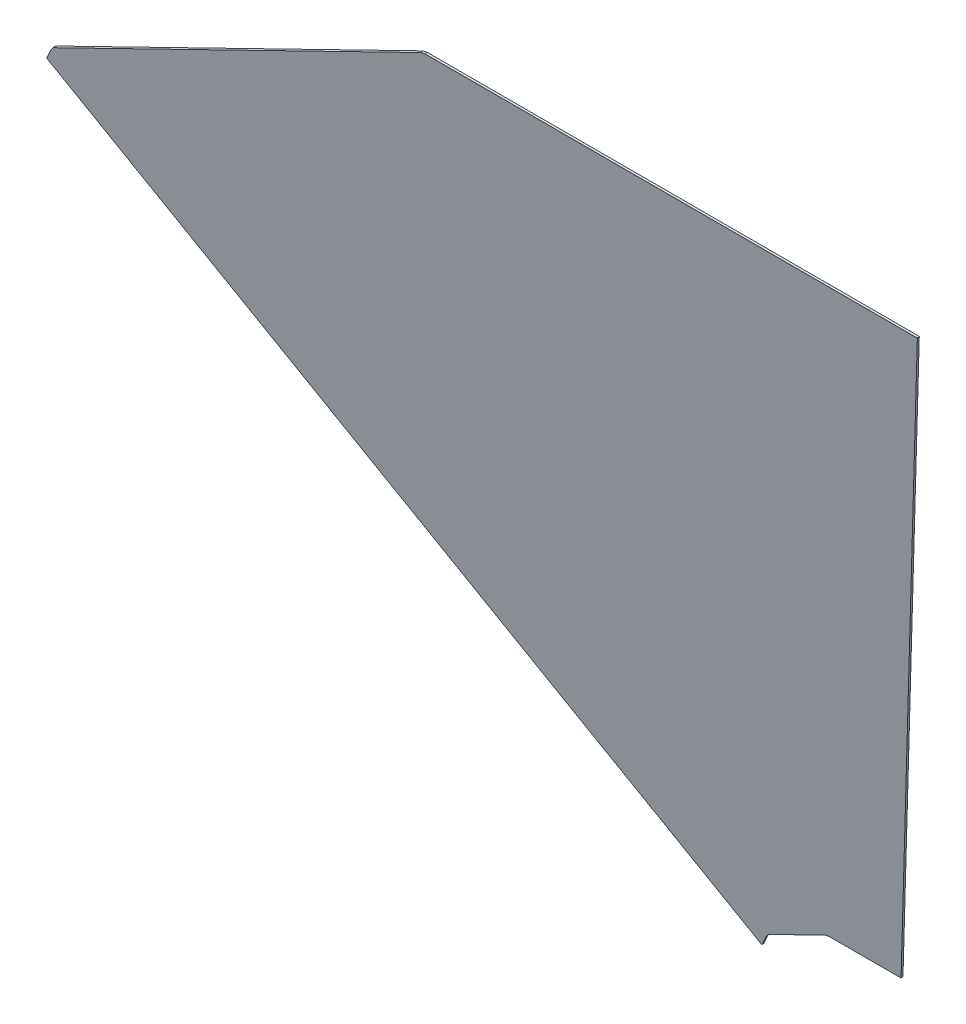
ISO-10303-21;
HEADER;
FILE_DESCRIPTION(('STEP AP214'),'2;1');
FILE_NAME('part.step','',(''),(''),'','','');
FILE_SCHEMA(('AUTOMOTIVE_DESIGN { 1 0 10303 214 1 1 1 1 }'));
ENDSEC;
DATA;
#1=APPLICATION_CONTEXT('core data for automotive mechanical design processes');
#2=APPLICATION_PROTOCOL_DEFINITION('international standard','automotive_design',2000,#1);
#3=PRODUCT_CONTEXT('',#1,'mechanical');
#4=PRODUCT('Part','Part','',(#3));
#5=PRODUCT_RELATED_PRODUCT_CATEGORY('part','',(#4));
#6=PRODUCT_DEFINITION_FORMATION('','',#4);
#7=PRODUCT_DEFINITION_CONTEXT('part definition',#1,'design');
#8=PRODUCT_DEFINITION('design','',#6,#7);
#9=PRODUCT_DEFINITION_SHAPE('','',#8);
#10=(LENGTH_UNIT() NAMED_UNIT(*) SI_UNIT(.MILLI.,.METRE.));
#11=(NAMED_UNIT(*) PLANE_ANGLE_UNIT() SI_UNIT($,.RADIAN.));
#12=(NAMED_UNIT(*) SI_UNIT($,.STERADIAN.) SOLID_ANGLE_UNIT());
#13=UNCERTAINTY_MEASURE_WITH_UNIT(LENGTH_MEASURE(1.E-05),#10,'distance_accuracy_value','');
#14=(GEOMETRIC_REPRESENTATION_CONTEXT(3) GLOBAL_UNCERTAINTY_ASSIGNED_CONTEXT((#13)) GLOBAL_UNIT_ASSIGNED_CONTEXT((#10,
#11,#12)) REPRESENTATION_CONTEXT('',''));
#15=CARTESIAN_POINT('',(0.,0.,0.));
#16=DIRECTION('',(0.,0.,1.));
#17=DIRECTION('',(1.,0.,0.));
#18=AXIS2_PLACEMENT_3D('',#15,#16,#17);
#19=CARTESIAN_POINT('',(-81.4927327948293,86.5041594757914,22.2174112125698));
#20=DIRECTION('',(0.502072542876718,-0.837725314470318,-0.214800975754098));
#21=DIRECTION('',(-0.864825509388631,-0.486339584462123,-0.124702232922686));
#22=AXIS2_PLACEMENT_3D('',#19,#20,#21);
#23=PLANE('',#22);
#24=DIRECTION('',(0.,-0.24837493045961,0.96866397368705));
#25=VECTOR('',#24,1.);
#26=CARTESIAN_POINT('',(-121.351346909395,63.9404143048598,17.0512557926561));
#27=LINE('',#26,#25);
#28=CARTESIAN_POINT('',(-121.351346909395,64.0894392631352,16.4700574084437));
#29=VERTEX_POINT('',#28);
#30=CARTESIAN_POINT('',(-121.351346909395,63.791389346584,17.6324541768683));
#31=VERTEX_POINT('',#30);
#32=EDGE_CURVE('E237',#29,#31,#27,.T.);
#33=ORIENTED_EDGE('',*,*,#32,.F.);
#34=DIRECTION('',(-0.864825509388632,-0.486339584462123,-0.124702232922685));
#35=VECTOR('',#34,1.);
#36=CARTESIAN_POINT('',(-81.492657451231,86.504201845696,22.2174220766283));
#37=LINE('',#36,#35);
#38=CARTESIAN_POINT('',(-81.4927327948294,86.5041594757914,22.2174112125698));
#39=VERTEX_POINT('',#38);
#40=EDGE_CURVE('E70',#39,#29,#37,.T.);
#41=ORIENTED_EDGE('',*,*,#40,.F.);
#42=DIRECTION('',(0.,0.24837493045961,-0.968663973687049));
#43=VECTOR('',#42,1.);
#44=CARTESIAN_POINT('',(-81.4927327948294,86.5041594757914,22.2174112125698));
#45=LINE('',#44,#43);
#46=CARTESIAN_POINT('',(-81.4927327948294,86.2061095592399,23.3798079809943));
#47=VERTEX_POINT('',#46);
#48=EDGE_CURVE('E54',#39,#47,#45,.F.);
#49=ORIENTED_EDGE('',*,*,#48,.T.);
#50=DIRECTION('',(-0.864825509388631,-0.486339584462123,-0.124702232922686));
#51=VECTOR('',#50,1.);
#52=CARTESIAN_POINT('',(-81.4927327948293,86.2061095592399,23.3798079809943));
#53=LINE('',#52,#51);
#54=EDGE_CURVE('E204',#47,#31,#53,.T.);
#55=ORIENTED_EDGE('',*,*,#54,.T.);
#56=EDGE_LOOP('',(#33,#41,#49,#55));
#57=FACE_BOUND('',#56,.T.);
#58=ADVANCED_FACE('F45',(#57),#23,.T.);
#59=CARTESIAN_POINT('',(-464.741445071575,394.337831515463,101.148979809011));
#60=DIRECTION('',(-0.502072542876719,0.837725314470321,0.214800975754088));
#61=DIRECTION('',(0.864825509388631,0.486339584462123,0.124702232922686));
#62=AXIS2_PLACEMENT_3D('',#59,#60,#61);
#63=PLANE('',#62);
#64=DIRECTION('',(0.,-0.248374930459611,0.968663973687049));
#65=VECTOR('',#64,1.);
#66=CARTESIAN_POINT('',(-207.292732794829,538.966566220514,138.852613800697));
#67=LINE('',#66,#65);
#68=CARTESIAN_POINT('',(-207.29273279483,539.11559117879,138.271415416485));
#69=VERTEX_POINT('',#68);
#70=CARTESIAN_POINT('',(-207.292732794829,538.817541262239,139.433812184909));
#71=VERTEX_POINT('',#70);
#72=EDGE_CURVE('E12',#69,#71,#67,.T.);
#73=ORIENTED_EDGE('',*,*,#72,.F.);
#74=DIRECTION('',(0.864825509388631,0.486339584462123,0.124702232922686));
#75=VECTOR('',#74,1.);
#76=CARTESIAN_POINT('',(-464.741445071575,394.337831515463,101.148979809011));
#77=LINE('',#76,#75);
#78=CARTESIAN_POINT('',(-464.741445071575,394.337831515464,101.148979809011));
#79=VERTEX_POINT('',#78);
#80=EDGE_CURVE('E62',#69,#79,#77,.F.);
#81=ORIENTED_EDGE('',*,*,#80,.T.);
#82=DIRECTION('',(0.,0.248374930459602,-0.968663973687051));
#83=VECTOR('',#82,1.);
#84=CARTESIAN_POINT('',(-464.741445071576,394.337831515463,101.148979809011));
#85=LINE('',#84,#83);
#86=CARTESIAN_POINT('',(-464.741445071575,394.039781598912,102.311376577435));
#87=VERTEX_POINT('',#86);
#88=EDGE_CURVE('E207',#79,#87,#85,.F.);
#89=ORIENTED_EDGE('',*,*,#88,.T.);
#90=DIRECTION('',(0.864825509388631,0.486339584462123,0.124702232922685));
#91=VECTOR('',#90,1.);
#92=CARTESIAN_POINT('',(-464.741445071575,394.039781598912,102.311376577435));
#93=LINE('',#92,#91);
#94=EDGE_CURVE('E208',#71,#87,#93,.F.);
#95=ORIENTED_EDGE('',*,*,#94,.F.);
#96=EDGE_LOOP('',(#73,#81,#89,#95));
#97=FACE_BOUND('',#96,.T.);
#98=ADVANCED_FACE('F282',(#97),#63,.T.);
#99=CARTESIAN_POINT('',(-114.,-0.306927143542762,1.19701801605478));
#100=DIRECTION('',(0.,0.248374930459612,-0.968663973687049));
#101=DIRECTION('',(0.,-0.968663973687049,-0.248374930459612));
#102=AXIS2_PLACEMENT_3D('',#99,#100,#101);
#103=PLANE('',#102);
#104=ORIENTED_EDGE('',*,*,#94,.T.);
#105=DIRECTION('',(-0.621655947087628,-0.758745211645701,-0.194549703817057));
#106=VECTOR('',#105,1.);
#107=CARTESIAN_POINT('',(-464.741445071575,394.039781598912,102.311376577435));
#108=LINE('',#107,#106);
#109=CARTESIAN_POINT('',(-466.428325961063,391.980905135956,101.783460486611));
#110=VERTEX_POINT('',#109);
#111=EDGE_CURVE('E218',#87,#110,#108,.T.);
#112=ORIENTED_EDGE('',*,*,#111,.T.);
#113=DIRECTION('',(-0.495846323378611,-0.841197757736622,-0.215691344218522));
#114=VECTOR('',#113,1.);
#115=CARTESIAN_POINT('',(-465.855281279463,392.953069047468,102.032732835409));
#116=LINE('',#115,#114);
#117=CARTESIAN_POINT('',(-470.99031138963,384.241547733465,99.7990134452606));
#118=VERTEX_POINT('',#117);
#119=EDGE_CURVE('E192',#118,#110,#116,.F.);
#120=ORIENTED_EDGE('',*,*,#119,.F.);
#121=DIRECTION('',(0.709642308138353,-0.682483952190832,-0.174995569949796));
#122=VECTOR('',#121,1.);
#123=CARTESIAN_POINT('',(-470.99031138963,384.241547733465,99.7990134452606));
#124=LINE('',#123,#122);
#125=CARTESIAN_POINT('',(-127.60021322745,53.9931554811372,15.1200910446933));
#126=VERTEX_POINT('',#125);
#127=EDGE_CURVE('E197',#126,#118,#124,.F.);
#128=ORIENTED_EDGE('',*,*,#127,.F.);
#129=DIRECTION('',(0.49584632337861,0.841197757736623,0.215691344218523));
#130=VECTOR('',#129,1.);
#131=CARTESIAN_POINT('',(-127.60021322745,53.9931554811372,15.1200910446933));
#132=LINE('',#131,#130);
#133=CARTESIAN_POINT('',(-123.038227798884,61.7325128836271,17.1045380860408));
#134=VERTEX_POINT('',#133);
#135=EDGE_CURVE('E176',#134,#126,#132,.F.);
#136=ORIENTED_EDGE('',*,*,#135,.F.);
#137=DIRECTION('',(0.621655947087619,0.75874521164571,0.194549703817052));
#138=VECTOR('',#137,1.);
#139=CARTESIAN_POINT('',(-123.038227798882,61.732512883628,17.1045380860436));
#140=LINE('',#139,#138);
#141=EDGE_CURVE('E213',#134,#31,#140,.T.);
#142=ORIENTED_EDGE('',*,*,#141,.T.);
#143=ORIENTED_EDGE('',*,*,#54,.F.);
#144=DIRECTION('',(0.965615220827785,0.251828872397682,0.0645713894276671));
#145=VECTOR('',#144,1.);
#146=CARTESIAN_POINT('',(-81.4927327948293,86.2061095592397,23.3798079809942));
#147=LINE('',#146,#145);
#148=CARTESIAN_POINT('',(-78.8886198219834,86.8852525754255,23.5539469022295));
#149=VERTEX_POINT('',#148);
#150=EDGE_CURVE('E229',#47,#149,#147,.T.);
#151=ORIENTED_EDGE('',*,*,#150,.T.);
#152=DIRECTION('',(-1.,0.,0.));
#153=VECTOR('',#152,1.);
#154=CARTESIAN_POINT('',(-35.906827580274,86.8852525754256,23.5539469022295));
#155=LINE('',#154,#153);
#156=CARTESIAN_POINT('',(-35.906827580274,86.8852525754255,23.5539469022296));
#157=VERTEX_POINT('',#156);
#158=EDGE_CURVE('E169',#157,#149,#155,.T.);
#159=ORIENTED_EDGE('',*,*,#158,.F.);
#160=DIRECTION('',(0.2599754705846,0.935356676859751,0.239834613323847));
#161=VECTOR('',#160,1.);
#162=CARTESIAN_POINT('',(-63.7814136844399,-13.4037484161088,-2.16113523541164));
#163=LINE('',#162,#161);
#164=CARTESIAN_POINT('',(89.8931724197261,539.496684278424,139.607951106145));
#165=VERTEX_POINT('',#164);
#166=EDGE_CURVE('E148',#157,#165,#163,.T.);
#167=ORIENTED_EDGE('',*,*,#166,.T.);
#168=DIRECTION('',(-1.,0.,0.));
#169=VECTOR('',#168,1.);
#170=CARTESIAN_POINT('',(-114.,539.496684278424,139.607951106144));
#171=LINE('',#170,#169);
#172=CARTESIAN_POINT('',(-204.688619821983,539.496684278424,139.607951106144));
#173=VERTEX_POINT('',#172);
#174=EDGE_CURVE('E143',#165,#173,#171,.T.);
#175=ORIENTED_EDGE('',*,*,#174,.T.);
#176=DIRECTION('',(-0.965615220827772,-0.251828872397731,-0.0645713894276717));
#177=VECTOR('',#176,1.);
#178=CARTESIAN_POINT('',(-204.688619821984,539.496684278424,139.607951106145));
#179=LINE('',#178,#177);
#180=EDGE_CURVE('E226',#173,#71,#179,.T.);
#181=ORIENTED_EDGE('',*,*,#180,.T.);
#182=EDGE_LOOP('',(#104,#112,#120,#128,#136,#142,#143,#151,#159,#167,#175,#181));
#183=FACE_BOUND('',#182,.T.);
#184=ADVANCED_FACE('F47',(#183),#103,.F.);
#185=CARTESIAN_POINT('',(-62.9345481407688,13.3088034420871,3.44940501157601));
#186=DIRECTION('',(0.,0.248374930459612,-0.968663973687049));
#187=DIRECTION('',(-0.859072998579085,0.495813645614607,0.127131474996138));
#188=AXIS2_PLACEMENT_3D('',#185,#186,#187);
#189=PLANE('',#188);
#190=ORIENTED_EDGE('',*,*,#80,.F.);
#191=DIRECTION('',(-0.965615220827772,-0.251828872397731,-0.0645713894276717));
#192=VECTOR('',#191,1.);
#193=CARTESIAN_POINT('',(-204.688619821984,539.794734194976,138.44555433772));
#194=LINE('',#193,#192);
#195=CARTESIAN_POINT('',(-204.688619821983,539.794734194976,138.44555433772));
#196=VERTEX_POINT('',#195);
#197=EDGE_CURVE('E154',#196,#69,#194,.T.);
#198=ORIENTED_EDGE('',*,*,#197,.F.);
#199=DIRECTION('',(1.,0.,0.));
#200=VECTOR('',#199,1.);
#201=CARTESIAN_POINT('',(-204.688619821983,539.794734194976,138.44555433772));
#202=LINE('',#201,#200);
#203=CARTESIAN_POINT('',(89.8931724197261,539.794734194976,138.44555433772));
#204=VERTEX_POINT('',#203);
#205=EDGE_CURVE('E141',#204,#196,#202,.F.);
#206=ORIENTED_EDGE('',*,*,#205,.F.);
#207=DIRECTION('',(0.2599754705846,0.935356676859751,0.239834613323847));
#208=VECTOR('',#207,1.);
#209=CARTESIAN_POINT('',(-63.7814136844399,-13.1056984995573,-3.32353200383609));
#210=LINE('',#209,#208);
#211=CARTESIAN_POINT('',(-35.906827580274,87.1833024919771,22.3915501338051));
#212=VERTEX_POINT('',#211);
#213=EDGE_CURVE('E149',#212,#204,#210,.T.);
#214=ORIENTED_EDGE('',*,*,#213,.F.);
#215=DIRECTION('',(-1.,0.,0.));
#216=VECTOR('',#215,1.);
#217=CARTESIAN_POINT('',(-114.,87.1833024919771,22.391550133805));
#218=LINE('',#217,#216);
#219=CARTESIAN_POINT('',(-78.8886198219835,87.1833024919772,22.3915501338051));
#220=VERTEX_POINT('',#219);
#221=EDGE_CURVE('E157',#212,#220,#218,.T.);
#222=ORIENTED_EDGE('',*,*,#221,.T.);
#223=DIRECTION('',(0.965615220827785,0.251828872397682,0.0645713894276671));
#224=VECTOR('',#223,1.);
#225=CARTESIAN_POINT('',(-81.4927327948293,86.5041594757912,22.2174112125698));
#226=LINE('',#225,#224);
#227=EDGE_CURVE('E230',#39,#220,#226,.T.);
#228=ORIENTED_EDGE('',*,*,#227,.F.);
#229=ORIENTED_EDGE('',*,*,#40,.T.);
#230=DIRECTION('',(0.621655947087619,0.75874521164571,0.194549703817052));
#231=VECTOR('',#230,1.);
#232=CARTESIAN_POINT('',(-123.038227798882,62.0305628001795,15.9421413176191));
#233=LINE('',#232,#231);
#234=CARTESIAN_POINT('',(-123.038227798884,62.0305628001781,15.9421413176186));
#235=VERTEX_POINT('',#234);
#236=EDGE_CURVE('E219',#235,#29,#233,.T.);
#237=ORIENTED_EDGE('',*,*,#236,.F.);
#238=DIRECTION('',(0.495846323378612,0.841197757736622,0.215691344218522));
#239=VECTOR('',#238,1.);
#240=CARTESIAN_POINT('',(-105.628379028865,91.5661770769643,23.5153621055828));
#241=LINE('',#240,#239);
#242=CARTESIAN_POINT('',(-127.60021322745,54.2912053976887,13.9576942762689));
#243=VERTEX_POINT('',#242);
#244=EDGE_CURVE('E188',#235,#243,#241,.F.);
#245=ORIENTED_EDGE('',*,*,#244,.T.);
#246=DIRECTION('',(0.709642308138353,-0.682483952190832,-0.174995569949796));
#247=VECTOR('',#246,1.);
#248=CARTESIAN_POINT('',(-470.99031138963,384.539597650017,98.6366166768361));
#249=LINE('',#248,#247);
#250=CARTESIAN_POINT('',(-470.99031138963,384.539597650017,98.6366166768361));
#251=VERTEX_POINT('',#250);
#252=EDGE_CURVE('E184',#243,#251,#249,.F.);
#253=ORIENTED_EDGE('',*,*,#252,.T.);
#254=DIRECTION('',(0.495846323378612,0.841197757736622,0.215691344218522));
#255=VECTOR('',#254,1.);
#256=CARTESIAN_POINT('',(-511.395944672074,315.991891406026,81.0603134034599));
#257=LINE('',#256,#255);
#258=CARTESIAN_POINT('',(-466.428325961063,392.278955052508,100.621063718186));
#259=VERTEX_POINT('',#258);
#260=EDGE_CURVE('E181',#251,#259,#257,.T.);
#261=ORIENTED_EDGE('',*,*,#260,.T.);
#262=DIRECTION('',(-0.621655947087628,-0.758745211645701,-0.194549703817057));
#263=VECTOR('',#262,1.);
#264=CARTESIAN_POINT('',(-464.741445071575,394.337831515463,101.148979809011));
#265=LINE('',#264,#263);
#266=EDGE_CURVE('E179',#79,#259,#265,.T.);
#267=ORIENTED_EDGE('',*,*,#266,.F.);
#268=EDGE_LOOP('',(#190,#198,#206,#214,#222,#228,#229,#237,#245,#253,#261,#267));
#269=FACE_BOUND('',#268,.T.);
#270=ADVANCED_FACE('F151',(#269),#189,.T.);
#271=CARTESIAN_POINT('',(-464.741445071575,394.188806557187,101.730178193223));
#272=DIRECTION('',(-0.783290420885245,0.602175719972088,0.154403752627694));
#273=DIRECTION('',(-0.621655947087628,-0.758745211645701,-0.194549703817057));
#274=AXIS2_PLACEMENT_3D('',#271,#272,#273);
#275=PLANE('',#274);
#276=ORIENTED_EDGE('',*,*,#88,.F.);
#277=ORIENTED_EDGE('',*,*,#266,.T.);
#278=DIRECTION('',(0.,-0.248374930459615,0.968663973687048));
#279=VECTOR('',#278,1.);
#280=CARTESIAN_POINT('',(-466.428325961063,392.129930094232,101.202262102398));
#281=LINE('',#280,#279);
#282=EDGE_CURVE('E203',#259,#110,#281,.T.);
#283=ORIENTED_EDGE('',*,*,#282,.T.);
#284=ORIENTED_EDGE('',*,*,#111,.F.);
#285=EDGE_LOOP('',(#276,#277,#283,#284));
#286=FACE_BOUND('',#285,.T.);
#287=ADVANCED_FACE('F280',(#286),#275,.T.);
#288=CARTESIAN_POINT('',(-123.038227798882,61.8815378419038,16.5233397018313));
#289=DIRECTION('',(0.783290420885253,-0.602175719972079,-0.154403752627691));
#290=DIRECTION('',(0.621655947087619,0.75874521164571,0.194549703817052));
#291=AXIS2_PLACEMENT_3D('',#288,#289,#290);
#292=PLANE('',#291);
#293=ORIENTED_EDGE('',*,*,#236,.T.);
#294=ORIENTED_EDGE('',*,*,#32,.T.);
#295=ORIENTED_EDGE('',*,*,#141,.F.);
#296=DIRECTION('',(0.,-0.248374930459612,0.968663973687049));
#297=VECTOR('',#296,1.);
#298=CARTESIAN_POINT('',(-123.038227798884,61.7325128836265,17.1045380860431));
#299=LINE('',#298,#297);
#300=EDGE_CURVE('E180',#235,#134,#299,.T.);
#301=ORIENTED_EDGE('',*,*,#300,.F.);
#302=EDGE_LOOP('',(#293,#294,#295,#301));
#303=FACE_BOUND('',#302,.T.);
#304=ADVANCED_FACE('F265',(#303),#292,.T.);
#305=CARTESIAN_POINT('',(-470.99031138963,384.241547733465,99.7990134452606));
#306=DIRECTION('',(-0.704562129623834,-0.687404938097746,-0.176257358935062));
#307=DIRECTION('',(0.709642308138353,-0.682483952190832,-0.174995569949796));
#308=AXIS2_PLACEMENT_3D('',#305,#306,#307);
#309=PLANE('',#308);
#310=DIRECTION('',(0.,-0.248374930459612,0.968663973687049));
#311=VECTOR('',#310,1.);
#312=CARTESIAN_POINT('',(-470.99031138963,384.241547733465,99.7990134452606));
#313=LINE('',#312,#311);
#314=EDGE_CURVE('E195',#251,#118,#313,.T.);
#315=ORIENTED_EDGE('',*,*,#314,.F.);
#316=ORIENTED_EDGE('',*,*,#252,.F.);
#317=DIRECTION('',(0.,-0.248374930459612,0.968663973687049));
#318=VECTOR('',#317,1.);
#319=CARTESIAN_POINT('',(-127.60021322745,53.9931554811372,15.1200910446933));
#320=LINE('',#319,#318);
#321=EDGE_CURVE('E201',#243,#126,#320,.T.);
#322=ORIENTED_EDGE('',*,*,#321,.T.);
#323=ORIENTED_EDGE('',*,*,#127,.T.);
#324=EDGE_LOOP('',(#315,#316,#322,#323));
#325=FACE_BOUND('',#324,.T.);
#326=ADVANCED_FACE('F271',(#325),#309,.T.);
#327=CARTESIAN_POINT('',(-465.855281279463,392.953069047468,102.032732835409));
#328=DIRECTION('',(-0.868410285286807,0.480308469942039,0.123155796087816));
#329=DIRECTION('',(-0.495846323378611,-0.841197757736622,-0.215691344218522));
#330=AXIS2_PLACEMENT_3D('',#327,#328,#329);
#331=PLANE('',#330);
#332=ORIENTED_EDGE('',*,*,#260,.F.);
#333=ORIENTED_EDGE('',*,*,#314,.T.);
#334=ORIENTED_EDGE('',*,*,#119,.T.);
#335=ORIENTED_EDGE('',*,*,#282,.F.);
#336=EDGE_LOOP('',(#332,#333,#334,#335));
#337=FACE_BOUND('',#336,.T.);
#338=ADVANCED_FACE('F275',(#337),#331,.T.);
#339=CARTESIAN_POINT('',(-127.60021322745,53.9931554811372,15.1200910446933));
#340=DIRECTION('',(0.868410285286808,-0.480308469942038,-0.123155796087816));
#341=DIRECTION('',(0.49584632337861,0.841197757736623,0.215691344218523));
#342=AXIS2_PLACEMENT_3D('',#339,#340,#341);
#343=PLANE('',#342);
#344=ORIENTED_EDGE('',*,*,#321,.F.);
#345=ORIENTED_EDGE('',*,*,#244,.F.);
#346=ORIENTED_EDGE('',*,*,#300,.T.);
#347=ORIENTED_EDGE('',*,*,#135,.T.);
#348=EDGE_LOOP('',(#344,#345,#346,#347));
#349=FACE_BOUND('',#348,.T.);
#350=ADVANCED_FACE('F267',(#349),#343,.T.);
#351=CARTESIAN_POINT('',(-204.688619821984,539.6457092367,139.026752721932));
#352=DIRECTION('',(-0.259975470584693,0.935356676859727,0.239834613323841));
#353=DIRECTION('',(-0.965615220827772,-0.251828872397731,-0.0645713894276717));
#354=AXIS2_PLACEMENT_3D('',#351,#352,#353);
#355=PLANE('',#354);
#356=DIRECTION('',(0.,0.24837493045965,-0.968663973687039));
#357=VECTOR('',#356,1.);
#358=CARTESIAN_POINT('',(-204.688619821983,539.794734194976,138.44555433772));
#359=LINE('',#358,#357);
#360=EDGE_CURVE('E156',#196,#173,#359,.F.);
#361=ORIENTED_EDGE('',*,*,#360,.F.);
#362=ORIENTED_EDGE('',*,*,#197,.T.);
#363=ORIENTED_EDGE('',*,*,#72,.T.);
#364=ORIENTED_EDGE('',*,*,#180,.F.);
#365=EDGE_LOOP('',(#361,#362,#363,#364));
#366=FACE_BOUND('',#365,.T.);
#367=ADVANCED_FACE('F285',(#366),#355,.T.);
#368=CARTESIAN_POINT('',(-81.4927327948293,86.3551345175155,22.798609596782));
#369=DIRECTION('',(0.259975470584644,-0.93535667685974,-0.239834613323844));
#370=DIRECTION('',(0.965615220827785,0.251828872397682,0.0645713894276671));
#371=AXIS2_PLACEMENT_3D('',#368,#369,#370);
#372=PLANE('',#371);
#373=ORIENTED_EDGE('',*,*,#227,.T.);
#374=DIRECTION('',(0.,-0.248374930459612,0.968663973687049));
#375=VECTOR('',#374,1.);
#376=CARTESIAN_POINT('',(-78.8886198219834,87.0342775337013,22.9727485180172));
#377=LINE('',#376,#375);
#378=EDGE_CURVE('E49',#220,#149,#377,.T.);
#379=ORIENTED_EDGE('',*,*,#378,.T.);
#380=ORIENTED_EDGE('',*,*,#150,.F.);
#381=ORIENTED_EDGE('',*,*,#48,.F.);
#382=EDGE_LOOP('',(#373,#379,#380,#381));
#383=FACE_BOUND('',#382,.T.);
#384=ADVANCED_FACE('F259',(#383),#372,.T.);
#385=CARTESIAN_POINT('',(-63.7814136844399,-13.4037484161088,-2.16113523541164));
#386=DIRECTION('',(-0.965615220827797,0.25182887239764,0.0645713894276548));
#387=DIRECTION('',(0.2599754705846,0.935356676859751,0.239834613323847));
#388=AXIS2_PLACEMENT_3D('',#385,#386,#387);
#389=PLANE('',#388);
#390=DIRECTION('',(0.,0.248374930459614,-0.968663973687048));
#391=VECTOR('',#390,1.);
#392=CARTESIAN_POINT('',(-35.906827580274,87.1833024919771,22.3915501338051));
#393=LINE('',#392,#391);
#394=EDGE_CURVE('E160',#212,#157,#393,.F.);
#395=ORIENTED_EDGE('',*,*,#394,.F.);
#396=ORIENTED_EDGE('',*,*,#213,.T.);
#397=DIRECTION('',(0.,0.248374930459612,-0.968663973687049));
#398=VECTOR('',#397,1.);
#399=CARTESIAN_POINT('',(89.8931724197262,539.496684278425,139.607951106145));
#400=LINE('',#399,#398);
#401=EDGE_CURVE('E137',#204,#165,#400,.F.);
#402=ORIENTED_EDGE('',*,*,#401,.T.);
#403=ORIENTED_EDGE('',*,*,#166,.F.);
#404=EDGE_LOOP('',(#395,#396,#402,#403));
#405=FACE_BOUND('',#404,.T.);
#406=ADVANCED_FACE('F159',(#405),#389,.F.);
#407=CARTESIAN_POINT('',(-35.906827580274,87.1833024919771,22.3915501338051));
#408=DIRECTION('',(0.,-0.968663973687048,-0.248374930459614));
#409=DIRECTION('',(-1.,0.,0.));
#410=AXIS2_PLACEMENT_3D('',#407,#408,#409);
#411=PLANE('',#410);
#412=ORIENTED_EDGE('',*,*,#378,.F.);
#413=ORIENTED_EDGE('',*,*,#221,.F.);
#414=ORIENTED_EDGE('',*,*,#394,.T.);
#415=ORIENTED_EDGE('',*,*,#158,.T.);
#416=EDGE_LOOP('',(#412,#413,#414,#415));
#417=FACE_BOUND('',#416,.T.);
#418=ADVANCED_FACE('F250',(#417),#411,.T.);
#419=CARTESIAN_POINT('',(-204.688619821983,539.794734194976,138.44555433772));
#420=DIRECTION('',(0.,0.968663973687039,0.24837493045965));
#421=DIRECTION('',(1.,0.,0.));
#422=AXIS2_PLACEMENT_3D('',#419,#420,#421);
#423=PLANE('',#422);
#424=ORIENTED_EDGE('',*,*,#401,.F.);
#425=ORIENTED_EDGE('',*,*,#205,.T.);
#426=ORIENTED_EDGE('',*,*,#360,.T.);
#427=ORIENTED_EDGE('',*,*,#174,.F.);
#428=EDGE_LOOP('',(#424,#425,#426,#427));
#429=FACE_BOUND('',#428,.T.);
#430=ADVANCED_FACE('F139',(#429),#423,.T.);
#431=CLOSED_SHELL('',(#58,#98,#184,#270,#287,#304,#326,#338,#350,#367,#384,#406,#418,#430));
#432=MANIFOLD_SOLID_BREP('B2',#431);
#433=ADVANCED_BREP_SHAPE_REPRESENTATION('',(#18,#432),#14);
#434=SHAPE_DEFINITION_REPRESENTATION(#9,#433);
ENDSEC;
END-ISO-10303-21;
